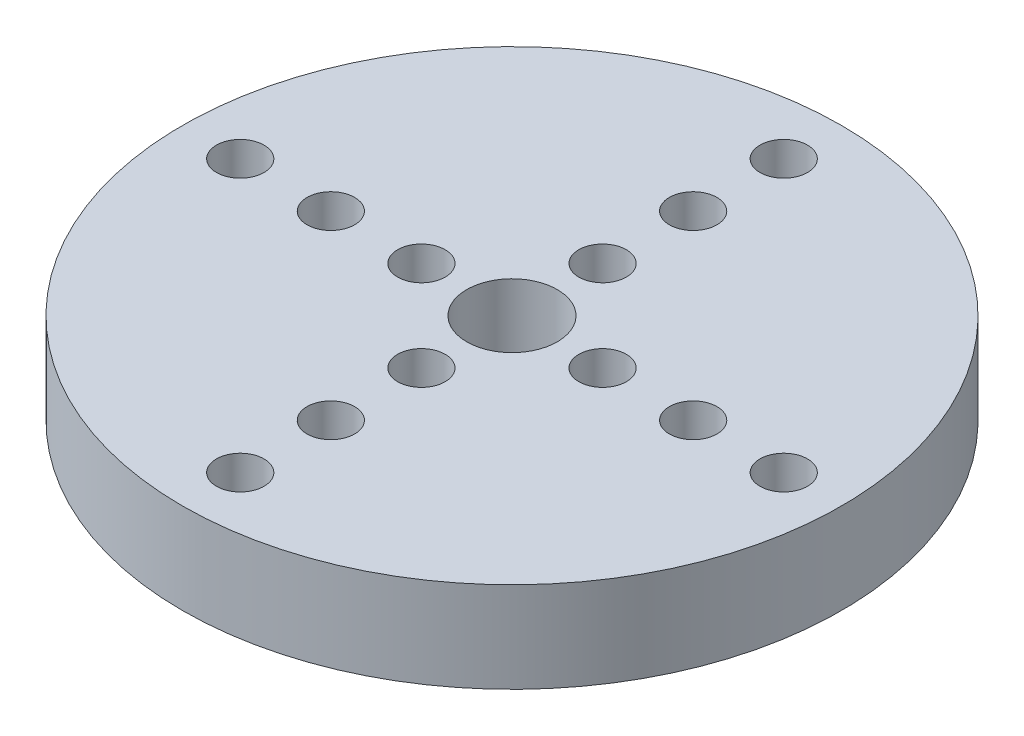
ISO-10303-21;
HEADER;
FILE_DESCRIPTION(('STEP AP214'),'2;1');
FILE_NAME('part.step','',(''),(''),'','','');
FILE_SCHEMA(('AUTOMOTIVE_DESIGN { 1 0 10303 214 1 1 1 1 }'));
ENDSEC;
DATA;
#1=APPLICATION_CONTEXT('core data for automotive mechanical design processes');
#2=APPLICATION_PROTOCOL_DEFINITION('international standard','automotive_design',2000,#1);
#3=PRODUCT_CONTEXT('',#1,'mechanical');
#4=PRODUCT('Part','Part','',(#3));
#5=PRODUCT_RELATED_PRODUCT_CATEGORY('part','',(#4));
#6=PRODUCT_DEFINITION_FORMATION('','',#4);
#7=PRODUCT_DEFINITION_CONTEXT('part definition',#1,'design');
#8=PRODUCT_DEFINITION('design','',#6,#7);
#9=PRODUCT_DEFINITION_SHAPE('','',#8);
#10=(LENGTH_UNIT() NAMED_UNIT(*) SI_UNIT(.MILLI.,.METRE.));
#11=(NAMED_UNIT(*) PLANE_ANGLE_UNIT() SI_UNIT($,.RADIAN.));
#12=(NAMED_UNIT(*) SI_UNIT($,.STERADIAN.) SOLID_ANGLE_UNIT());
#13=UNCERTAINTY_MEASURE_WITH_UNIT(LENGTH_MEASURE(1.E-05),#10,'distance_accuracy_value','');
#14=(GEOMETRIC_REPRESENTATION_CONTEXT(3) GLOBAL_UNCERTAINTY_ASSIGNED_CONTEXT((#13)) GLOBAL_UNIT_ASSIGNED_CONTEXT((#10,
#11,#12)) REPRESENTATION_CONTEXT('',''));
#15=CARTESIAN_POINT('',(0.,0.,0.));
#16=DIRECTION('',(0.,0.,1.));
#17=DIRECTION('',(1.,0.,0.));
#18=AXIS2_PLACEMENT_3D('',#15,#16,#17);
#19=CARTESIAN_POINT('',(0.,8.,0.));
#20=DIRECTION('',(0.,-1.,0.));
#21=DIRECTION('',(0.,0.,-1.));
#22=AXIS2_PLACEMENT_3D('',#19,#20,#21);
#23=CYLINDRICAL_SURFACE('',#22,29.105);
#24=CARTESIAN_POINT('',(0.,8.,0.));
#25=DIRECTION('',(0.,1.,0.));
#26=DIRECTION('',(0.,0.,1.));
#27=AXIS2_PLACEMENT_3D('',#24,#25,#26);
#28=CIRCLE('',#27,29.105);
#29=CARTESIAN_POINT('',(0.,8.,29.105));
#30=VERTEX_POINT('',#29);
#31=EDGE_CURVE('E10',#30,#30,#28,.T.);
#32=ORIENTED_EDGE('',*,*,#31,.F.);
#33=EDGE_LOOP('',(#32));
#34=FACE_BOUND('',#33,.T.);
#35=CARTESIAN_POINT('',(0.,0.,0.));
#36=DIRECTION('',(0.,1.,0.));
#37=DIRECTION('',(0.,0.,1.));
#38=AXIS2_PLACEMENT_3D('',#35,#36,#37);
#39=CIRCLE('',#38,29.105);
#40=CARTESIAN_POINT('',(0.,0.,29.105));
#41=VERTEX_POINT('',#40);
#42=EDGE_CURVE('E34',#41,#41,#39,.T.);
#43=ORIENTED_EDGE('',*,*,#42,.T.);
#44=EDGE_LOOP('',(#43));
#45=FACE_BOUND('',#44,.T.);
#46=ADVANCED_FACE('F31',(#34,#45),#23,.T.);
#47=CARTESIAN_POINT('',(0.,8.,0.));
#48=DIRECTION('',(0.,1.,0.));
#49=DIRECTION('',(0.,0.,1.));
#50=AXIS2_PLACEMENT_3D('',#47,#48,#49);
#51=PLANE('',#50);
#52=CARTESIAN_POINT('',(24.,8.,0.));
#53=DIRECTION('',(0.,1.,0.));
#54=DIRECTION('',(0.,0.,1.));
#55=AXIS2_PLACEMENT_3D('',#52,#53,#54);
#56=CIRCLE('',#55,2.1);
#57=CARTESIAN_POINT('',(24.,8.,2.1));
#58=VERTEX_POINT('',#57);
#59=EDGE_CURVE('E115',#58,#58,#56,.T.);
#60=ORIENTED_EDGE('',*,*,#59,.F.);
#61=EDGE_LOOP('',(#60));
#62=FACE_BOUND('',#61,.T.);
#63=CARTESIAN_POINT('',(16.,8.,0.));
#64=DIRECTION('',(0.,1.,0.));
#65=DIRECTION('',(0.,0.,1.));
#66=AXIS2_PLACEMENT_3D('',#63,#64,#65);
#67=CIRCLE('',#66,2.1);
#68=CARTESIAN_POINT('',(16.,8.,2.1));
#69=VERTEX_POINT('',#68);
#70=EDGE_CURVE('E109',#69,#69,#67,.T.);
#71=ORIENTED_EDGE('',*,*,#70,.F.);
#72=EDGE_LOOP('',(#71));
#73=FACE_BOUND('',#72,.T.);
#74=CARTESIAN_POINT('',(8.,8.,0.));
#75=DIRECTION('',(0.,1.,0.));
#76=DIRECTION('',(0.,0.,1.));
#77=AXIS2_PLACEMENT_3D('',#74,#75,#76);
#78=CIRCLE('',#77,2.1);
#79=CARTESIAN_POINT('',(8.,8.,2.1));
#80=VERTEX_POINT('',#79);
#81=EDGE_CURVE('E103',#80,#80,#78,.T.);
#82=ORIENTED_EDGE('',*,*,#81,.F.);
#83=EDGE_LOOP('',(#82));
#84=FACE_BOUND('',#83,.T.);
#85=CARTESIAN_POINT('',(0.,8.,24.));
#86=DIRECTION('',(0.,1.,0.));
#87=DIRECTION('',(0.,0.,1.));
#88=AXIS2_PLACEMENT_3D('',#85,#86,#87);
#89=CIRCLE('',#88,2.1);
#90=CARTESIAN_POINT('',(0.,8.,26.1));
#91=VERTEX_POINT('',#90);
#92=EDGE_CURVE('E97',#91,#91,#89,.T.);
#93=ORIENTED_EDGE('',*,*,#92,.F.);
#94=EDGE_LOOP('',(#93));
#95=FACE_BOUND('',#94,.T.);
#96=CARTESIAN_POINT('',(0.,8.,16.));
#97=DIRECTION('',(0.,1.,0.));
#98=DIRECTION('',(0.,0.,1.));
#99=AXIS2_PLACEMENT_3D('',#96,#97,#98);
#100=CIRCLE('',#99,2.1);
#101=CARTESIAN_POINT('',(0.,8.,18.1));
#102=VERTEX_POINT('',#101);
#103=EDGE_CURVE('E91',#102,#102,#100,.T.);
#104=ORIENTED_EDGE('',*,*,#103,.F.);
#105=EDGE_LOOP('',(#104));
#106=FACE_BOUND('',#105,.T.);
#107=CARTESIAN_POINT('',(0.,8.,8.));
#108=DIRECTION('',(0.,1.,0.));
#109=DIRECTION('',(0.,0.,1.));
#110=AXIS2_PLACEMENT_3D('',#107,#108,#109);
#111=CIRCLE('',#110,2.1);
#112=CARTESIAN_POINT('',(0.,8.,10.1));
#113=VERTEX_POINT('',#112);
#114=EDGE_CURVE('E85',#113,#113,#111,.T.);
#115=ORIENTED_EDGE('',*,*,#114,.F.);
#116=EDGE_LOOP('',(#115));
#117=FACE_BOUND('',#116,.T.);
#118=CARTESIAN_POINT('',(-24.,8.,0.));
#119=DIRECTION('',(0.,1.,0.));
#120=DIRECTION('',(0.,0.,1.));
#121=AXIS2_PLACEMENT_3D('',#118,#119,#120);
#122=CIRCLE('',#121,2.1);
#123=CARTESIAN_POINT('',(-24.,8.,2.1));
#124=VERTEX_POINT('',#123);
#125=EDGE_CURVE('E79',#124,#124,#122,.T.);
#126=ORIENTED_EDGE('',*,*,#125,.F.);
#127=EDGE_LOOP('',(#126));
#128=FACE_BOUND('',#127,.T.);
#129=CARTESIAN_POINT('',(-16.,8.,0.));
#130=DIRECTION('',(0.,1.,0.));
#131=DIRECTION('',(0.,0.,1.));
#132=AXIS2_PLACEMENT_3D('',#129,#130,#131);
#133=CIRCLE('',#132,2.1);
#134=CARTESIAN_POINT('',(-16.,8.,2.1));
#135=VERTEX_POINT('',#134);
#136=EDGE_CURVE('E73',#135,#135,#133,.T.);
#137=ORIENTED_EDGE('',*,*,#136,.F.);
#138=EDGE_LOOP('',(#137));
#139=FACE_BOUND('',#138,.T.);
#140=CARTESIAN_POINT('',(-8.,8.,0.));
#141=DIRECTION('',(0.,1.,0.));
#142=DIRECTION('',(0.,0.,1.));
#143=AXIS2_PLACEMENT_3D('',#140,#141,#142);
#144=CIRCLE('',#143,2.1);
#145=CARTESIAN_POINT('',(-8.,8.,2.1));
#146=VERTEX_POINT('',#145);
#147=EDGE_CURVE('E67',#146,#146,#144,.T.);
#148=ORIENTED_EDGE('',*,*,#147,.F.);
#149=EDGE_LOOP('',(#148));
#150=FACE_BOUND('',#149,.T.);
#151=CARTESIAN_POINT('',(0.,8.,-24.));
#152=DIRECTION('',(0.,1.,0.));
#153=DIRECTION('',(0.,0.,1.));
#154=AXIS2_PLACEMENT_3D('',#151,#152,#153);
#155=CIRCLE('',#154,2.1);
#156=CARTESIAN_POINT('',(0.,8.,-21.9));
#157=VERTEX_POINT('',#156);
#158=EDGE_CURVE('E61',#157,#157,#155,.T.);
#159=ORIENTED_EDGE('',*,*,#158,.F.);
#160=EDGE_LOOP('',(#159));
#161=FACE_BOUND('',#160,.T.);
#162=CARTESIAN_POINT('',(0.,8.,-16.));
#163=DIRECTION('',(0.,1.,0.));
#164=DIRECTION('',(0.,0.,1.));
#165=AXIS2_PLACEMENT_3D('',#162,#163,#164);
#166=CIRCLE('',#165,2.1);
#167=CARTESIAN_POINT('',(0.,8.,-13.9));
#168=VERTEX_POINT('',#167);
#169=EDGE_CURVE('E55',#168,#168,#166,.T.);
#170=ORIENTED_EDGE('',*,*,#169,.F.);
#171=EDGE_LOOP('',(#170));
#172=FACE_BOUND('',#171,.T.);
#173=CARTESIAN_POINT('',(0.,8.,-8.));
#174=DIRECTION('',(0.,1.,0.));
#175=DIRECTION('',(0.,0.,1.));
#176=AXIS2_PLACEMENT_3D('',#173,#174,#175);
#177=CIRCLE('',#176,2.1);
#178=CARTESIAN_POINT('',(0.,8.,-5.9));
#179=VERTEX_POINT('',#178);
#180=EDGE_CURVE('E49',#179,#179,#177,.T.);
#181=ORIENTED_EDGE('',*,*,#180,.F.);
#182=EDGE_LOOP('',(#181));
#183=FACE_BOUND('',#182,.T.);
#184=CARTESIAN_POINT('',(0.,8.,0.));
#185=DIRECTION('',(0.,1.,0.));
#186=DIRECTION('',(0.,0.,1.));
#187=AXIS2_PLACEMENT_3D('',#184,#185,#186);
#188=CIRCLE('',#187,4.);
#189=CARTESIAN_POINT('',(0.,8.,4.));
#190=VERTEX_POINT('',#189);
#191=EDGE_CURVE('E43',#190,#190,#188,.T.);
#192=ORIENTED_EDGE('',*,*,#191,.F.);
#193=EDGE_LOOP('',(#192));
#194=FACE_BOUND('',#193,.T.);
#195=ORIENTED_EDGE('',*,*,#31,.T.);
#196=EDGE_LOOP('',(#195));
#197=FACE_BOUND('',#196,.T.);
#198=ADVANCED_FACE('F131',(#62,#73,#84,#95,#106,#117,#128,#139,#150,#161,#172,#183,#194,#197),
#51,.T.);
#199=CARTESIAN_POINT('',(0.,0.,0.));
#200=DIRECTION('',(0.,1.,0.));
#201=DIRECTION('',(0.,0.,1.));
#202=AXIS2_PLACEMENT_3D('',#199,#200,#201);
#203=PLANE('',#202);
#204=CARTESIAN_POINT('',(24.,0.,0.));
#205=DIRECTION('',(0.,1.,0.));
#206=DIRECTION('',(0.,0.,1.));
#207=AXIS2_PLACEMENT_3D('',#204,#205,#206);
#208=CIRCLE('',#207,2.1);
#209=CARTESIAN_POINT('',(24.,0.,2.1));
#210=VERTEX_POINT('',#209);
#211=EDGE_CURVE('E112',#210,#210,#208,.T.);
#212=ORIENTED_EDGE('',*,*,#211,.T.);
#213=EDGE_LOOP('',(#212));
#214=FACE_BOUND('',#213,.T.);
#215=CARTESIAN_POINT('',(16.,0.,0.));
#216=DIRECTION('',(0.,1.,0.));
#217=DIRECTION('',(0.,0.,1.));
#218=AXIS2_PLACEMENT_3D('',#215,#216,#217);
#219=CIRCLE('',#218,2.1);
#220=CARTESIAN_POINT('',(16.,0.,2.1));
#221=VERTEX_POINT('',#220);
#222=EDGE_CURVE('E106',#221,#221,#219,.T.);
#223=ORIENTED_EDGE('',*,*,#222,.T.);
#224=EDGE_LOOP('',(#223));
#225=FACE_BOUND('',#224,.T.);
#226=CARTESIAN_POINT('',(8.,0.,0.));
#227=DIRECTION('',(0.,1.,0.));
#228=DIRECTION('',(0.,0.,1.));
#229=AXIS2_PLACEMENT_3D('',#226,#227,#228);
#230=CIRCLE('',#229,2.1);
#231=CARTESIAN_POINT('',(8.,0.,2.1));
#232=VERTEX_POINT('',#231);
#233=EDGE_CURVE('E100',#232,#232,#230,.T.);
#234=ORIENTED_EDGE('',*,*,#233,.T.);
#235=EDGE_LOOP('',(#234));
#236=FACE_BOUND('',#235,.T.);
#237=CARTESIAN_POINT('',(0.,0.,24.));
#238=DIRECTION('',(0.,1.,0.));
#239=DIRECTION('',(0.,0.,1.));
#240=AXIS2_PLACEMENT_3D('',#237,#238,#239);
#241=CIRCLE('',#240,2.1);
#242=CARTESIAN_POINT('',(0.,0.,26.1));
#243=VERTEX_POINT('',#242);
#244=EDGE_CURVE('E94',#243,#243,#241,.T.);
#245=ORIENTED_EDGE('',*,*,#244,.T.);
#246=EDGE_LOOP('',(#245));
#247=FACE_BOUND('',#246,.T.);
#248=CARTESIAN_POINT('',(0.,0.,16.));
#249=DIRECTION('',(0.,1.,0.));
#250=DIRECTION('',(0.,0.,1.));
#251=AXIS2_PLACEMENT_3D('',#248,#249,#250);
#252=CIRCLE('',#251,2.1);
#253=CARTESIAN_POINT('',(0.,0.,18.1));
#254=VERTEX_POINT('',#253);
#255=EDGE_CURVE('E88',#254,#254,#252,.T.);
#256=ORIENTED_EDGE('',*,*,#255,.T.);
#257=EDGE_LOOP('',(#256));
#258=FACE_BOUND('',#257,.T.);
#259=CARTESIAN_POINT('',(0.,0.,8.));
#260=DIRECTION('',(0.,1.,0.));
#261=DIRECTION('',(0.,0.,1.));
#262=AXIS2_PLACEMENT_3D('',#259,#260,#261);
#263=CIRCLE('',#262,2.1);
#264=CARTESIAN_POINT('',(0.,0.,10.1));
#265=VERTEX_POINT('',#264);
#266=EDGE_CURVE('E82',#265,#265,#263,.T.);
#267=ORIENTED_EDGE('',*,*,#266,.T.);
#268=EDGE_LOOP('',(#267));
#269=FACE_BOUND('',#268,.T.);
#270=CARTESIAN_POINT('',(-24.,0.,0.));
#271=DIRECTION('',(0.,1.,0.));
#272=DIRECTION('',(0.,0.,1.));
#273=AXIS2_PLACEMENT_3D('',#270,#271,#272);
#274=CIRCLE('',#273,2.1);
#275=CARTESIAN_POINT('',(-24.,0.,2.1));
#276=VERTEX_POINT('',#275);
#277=EDGE_CURVE('E76',#276,#276,#274,.T.);
#278=ORIENTED_EDGE('',*,*,#277,.T.);
#279=EDGE_LOOP('',(#278));
#280=FACE_BOUND('',#279,.T.);
#281=CARTESIAN_POINT('',(-16.,0.,0.));
#282=DIRECTION('',(0.,1.,0.));
#283=DIRECTION('',(0.,0.,1.));
#284=AXIS2_PLACEMENT_3D('',#281,#282,#283);
#285=CIRCLE('',#284,2.1);
#286=CARTESIAN_POINT('',(-16.,0.,2.1));
#287=VERTEX_POINT('',#286);
#288=EDGE_CURVE('E70',#287,#287,#285,.T.);
#289=ORIENTED_EDGE('',*,*,#288,.T.);
#290=EDGE_LOOP('',(#289));
#291=FACE_BOUND('',#290,.T.);
#292=CARTESIAN_POINT('',(-8.,0.,0.));
#293=DIRECTION('',(0.,1.,0.));
#294=DIRECTION('',(0.,0.,1.));
#295=AXIS2_PLACEMENT_3D('',#292,#293,#294);
#296=CIRCLE('',#295,2.1);
#297=CARTESIAN_POINT('',(-8.,0.,2.1));
#298=VERTEX_POINT('',#297);
#299=EDGE_CURVE('E64',#298,#298,#296,.T.);
#300=ORIENTED_EDGE('',*,*,#299,.T.);
#301=EDGE_LOOP('',(#300));
#302=FACE_BOUND('',#301,.T.);
#303=CARTESIAN_POINT('',(0.,0.,-24.));
#304=DIRECTION('',(0.,1.,0.));
#305=DIRECTION('',(0.,0.,1.));
#306=AXIS2_PLACEMENT_3D('',#303,#304,#305);
#307=CIRCLE('',#306,2.1);
#308=CARTESIAN_POINT('',(0.,0.,-21.9));
#309=VERTEX_POINT('',#308);
#310=EDGE_CURVE('E58',#309,#309,#307,.T.);
#311=ORIENTED_EDGE('',*,*,#310,.T.);
#312=EDGE_LOOP('',(#311));
#313=FACE_BOUND('',#312,.T.);
#314=CARTESIAN_POINT('',(0.,0.,-16.));
#315=DIRECTION('',(0.,1.,0.));
#316=DIRECTION('',(0.,0.,1.));
#317=AXIS2_PLACEMENT_3D('',#314,#315,#316);
#318=CIRCLE('',#317,2.1);
#319=CARTESIAN_POINT('',(0.,0.,-13.9));
#320=VERTEX_POINT('',#319);
#321=EDGE_CURVE('E52',#320,#320,#318,.T.);
#322=ORIENTED_EDGE('',*,*,#321,.T.);
#323=EDGE_LOOP('',(#322));
#324=FACE_BOUND('',#323,.T.);
#325=CARTESIAN_POINT('',(0.,0.,-8.));
#326=DIRECTION('',(0.,1.,0.));
#327=DIRECTION('',(0.,0.,1.));
#328=AXIS2_PLACEMENT_3D('',#325,#326,#327);
#329=CIRCLE('',#328,2.1);
#330=CARTESIAN_POINT('',(0.,0.,-5.9));
#331=VERTEX_POINT('',#330);
#332=EDGE_CURVE('E46',#331,#331,#329,.T.);
#333=ORIENTED_EDGE('',*,*,#332,.T.);
#334=EDGE_LOOP('',(#333));
#335=FACE_BOUND('',#334,.T.);
#336=CARTESIAN_POINT('',(0.,0.,0.));
#337=DIRECTION('',(0.,1.,0.));
#338=DIRECTION('',(0.,0.,1.));
#339=AXIS2_PLACEMENT_3D('',#336,#337,#338);
#340=CIRCLE('',#339,4.);
#341=CARTESIAN_POINT('',(0.,0.,4.));
#342=VERTEX_POINT('',#341);
#343=EDGE_CURVE('E41',#342,#342,#340,.T.);
#344=ORIENTED_EDGE('',*,*,#343,.T.);
#345=EDGE_LOOP('',(#344));
#346=FACE_BOUND('',#345,.T.);
#347=ORIENTED_EDGE('',*,*,#42,.F.);
#348=EDGE_LOOP('',(#347));
#349=FACE_BOUND('',#348,.T.);
#350=ADVANCED_FACE('F121',(#214,#225,#236,#247,#258,#269,#280,#291,#302,#313,#324,#335,#346,
#349),#203,.F.);
#351=CARTESIAN_POINT('',(0.,0.,0.));
#352=DIRECTION('',(0.,1.,0.));
#353=DIRECTION('',(0.,0.,1.));
#354=AXIS2_PLACEMENT_3D('',#351,#352,#353);
#355=CYLINDRICAL_SURFACE('',#354,4.);
#356=ORIENTED_EDGE('',*,*,#343,.F.);
#357=EDGE_LOOP('',(#356));
#358=FACE_BOUND('',#357,.T.);
#359=ORIENTED_EDGE('',*,*,#191,.T.);
#360=EDGE_LOOP('',(#359));
#361=FACE_BOUND('',#360,.T.);
#362=ADVANCED_FACE('F159',(#358,#361),#355,.F.);
#363=CARTESIAN_POINT('',(0.,0.,-8.));
#364=DIRECTION('',(0.,1.,0.));
#365=DIRECTION('',(0.,0.,1.));
#366=AXIS2_PLACEMENT_3D('',#363,#364,#365);
#367=CYLINDRICAL_SURFACE('',#366,2.1);
#368=ORIENTED_EDGE('',*,*,#332,.F.);
#369=EDGE_LOOP('',(#368));
#370=FACE_BOUND('',#369,.T.);
#371=ORIENTED_EDGE('',*,*,#180,.T.);
#372=EDGE_LOOP('',(#371));
#373=FACE_BOUND('',#372,.T.);
#374=ADVANCED_FACE('F161',(#370,#373),#367,.F.);
#375=CARTESIAN_POINT('',(0.,0.,-16.));
#376=DIRECTION('',(0.,1.,0.));
#377=DIRECTION('',(0.,0.,1.));
#378=AXIS2_PLACEMENT_3D('',#375,#376,#377);
#379=CYLINDRICAL_SURFACE('',#378,2.1);
#380=ORIENTED_EDGE('',*,*,#321,.F.);
#381=EDGE_LOOP('',(#380));
#382=FACE_BOUND('',#381,.T.);
#383=ORIENTED_EDGE('',*,*,#169,.T.);
#384=EDGE_LOOP('',(#383));
#385=FACE_BOUND('',#384,.T.);
#386=ADVANCED_FACE('F168',(#382,#385),#379,.F.);
#387=CARTESIAN_POINT('',(0.,0.,-24.));
#388=DIRECTION('',(0.,1.,0.));
#389=DIRECTION('',(0.,0.,1.));
#390=AXIS2_PLACEMENT_3D('',#387,#388,#389);
#391=CYLINDRICAL_SURFACE('',#390,2.1);
#392=ORIENTED_EDGE('',*,*,#310,.F.);
#393=EDGE_LOOP('',(#392));
#394=FACE_BOUND('',#393,.T.);
#395=ORIENTED_EDGE('',*,*,#158,.T.);
#396=EDGE_LOOP('',(#395));
#397=FACE_BOUND('',#396,.T.);
#398=ADVANCED_FACE('F203',(#394,#397),#391,.F.);
#399=CARTESIAN_POINT('',(-8.,0.,0.));
#400=DIRECTION('',(0.,1.,0.));
#401=DIRECTION('',(0.,0.,1.));
#402=AXIS2_PLACEMENT_3D('',#399,#400,#401);
#403=CYLINDRICAL_SURFACE('',#402,2.1);
#404=ORIENTED_EDGE('',*,*,#299,.F.);
#405=EDGE_LOOP('',(#404));
#406=FACE_BOUND('',#405,.T.);
#407=ORIENTED_EDGE('',*,*,#147,.T.);
#408=EDGE_LOOP('',(#407));
#409=FACE_BOUND('',#408,.T.);
#410=ADVANCED_FACE('F213',(#406,#409),#403,.F.);
#411=CARTESIAN_POINT('',(-16.,0.,0.));
#412=DIRECTION('',(0.,1.,0.));
#413=DIRECTION('',(0.,0.,1.));
#414=AXIS2_PLACEMENT_3D('',#411,#412,#413);
#415=CYLINDRICAL_SURFACE('',#414,2.1);
#416=ORIENTED_EDGE('',*,*,#288,.F.);
#417=EDGE_LOOP('',(#416));
#418=FACE_BOUND('',#417,.T.);
#419=ORIENTED_EDGE('',*,*,#136,.T.);
#420=EDGE_LOOP('',(#419));
#421=FACE_BOUND('',#420,.T.);
#422=ADVANCED_FACE('F223',(#418,#421),#415,.F.);
#423=CARTESIAN_POINT('',(-24.,0.,0.));
#424=DIRECTION('',(0.,1.,0.));
#425=DIRECTION('',(0.,0.,1.));
#426=AXIS2_PLACEMENT_3D('',#423,#424,#425);
#427=CYLINDRICAL_SURFACE('',#426,2.1);
#428=ORIENTED_EDGE('',*,*,#277,.F.);
#429=EDGE_LOOP('',(#428));
#430=FACE_BOUND('',#429,.T.);
#431=ORIENTED_EDGE('',*,*,#125,.T.);
#432=EDGE_LOOP('',(#431));
#433=FACE_BOUND('',#432,.T.);
#434=ADVANCED_FACE('F233',(#430,#433),#427,.F.);
#435=CARTESIAN_POINT('',(0.,0.,8.));
#436=DIRECTION('',(0.,1.,0.));
#437=DIRECTION('',(0.,0.,1.));
#438=AXIS2_PLACEMENT_3D('',#435,#436,#437);
#439=CYLINDRICAL_SURFACE('',#438,2.1);
#440=ORIENTED_EDGE('',*,*,#266,.F.);
#441=EDGE_LOOP('',(#440));
#442=FACE_BOUND('',#441,.T.);
#443=ORIENTED_EDGE('',*,*,#114,.T.);
#444=EDGE_LOOP('',(#443));
#445=FACE_BOUND('',#444,.T.);
#446=ADVANCED_FACE('F243',(#442,#445),#439,.F.);
#447=CARTESIAN_POINT('',(0.,0.,16.));
#448=DIRECTION('',(0.,1.,0.));
#449=DIRECTION('',(0.,0.,1.));
#450=AXIS2_PLACEMENT_3D('',#447,#448,#449);
#451=CYLINDRICAL_SURFACE('',#450,2.1);
#452=ORIENTED_EDGE('',*,*,#255,.F.);
#453=EDGE_LOOP('',(#452));
#454=FACE_BOUND('',#453,.T.);
#455=ORIENTED_EDGE('',*,*,#103,.T.);
#456=EDGE_LOOP('',(#455));
#457=FACE_BOUND('',#456,.T.);
#458=ADVANCED_FACE('F253',(#454,#457),#451,.F.);
#459=CARTESIAN_POINT('',(0.,0.,24.));
#460=DIRECTION('',(0.,1.,0.));
#461=DIRECTION('',(0.,0.,1.));
#462=AXIS2_PLACEMENT_3D('',#459,#460,#461);
#463=CYLINDRICAL_SURFACE('',#462,2.1);
#464=ORIENTED_EDGE('',*,*,#244,.F.);
#465=EDGE_LOOP('',(#464));
#466=FACE_BOUND('',#465,.T.);
#467=ORIENTED_EDGE('',*,*,#92,.T.);
#468=EDGE_LOOP('',(#467));
#469=FACE_BOUND('',#468,.T.);
#470=ADVANCED_FACE('F263',(#466,#469),#463,.F.);
#471=CARTESIAN_POINT('',(8.,0.,0.));
#472=DIRECTION('',(0.,1.,0.));
#473=DIRECTION('',(0.,0.,1.));
#474=AXIS2_PLACEMENT_3D('',#471,#472,#473);
#475=CYLINDRICAL_SURFACE('',#474,2.1);
#476=ORIENTED_EDGE('',*,*,#233,.F.);
#477=EDGE_LOOP('',(#476));
#478=FACE_BOUND('',#477,.T.);
#479=ORIENTED_EDGE('',*,*,#81,.T.);
#480=EDGE_LOOP('',(#479));
#481=FACE_BOUND('',#480,.T.);
#482=ADVANCED_FACE('F273',(#478,#481),#475,.F.);
#483=CARTESIAN_POINT('',(16.,0.,0.));
#484=DIRECTION('',(0.,1.,0.));
#485=DIRECTION('',(0.,0.,1.));
#486=AXIS2_PLACEMENT_3D('',#483,#484,#485);
#487=CYLINDRICAL_SURFACE('',#486,2.1);
#488=ORIENTED_EDGE('',*,*,#222,.F.);
#489=EDGE_LOOP('',(#488));
#490=FACE_BOUND('',#489,.T.);
#491=ORIENTED_EDGE('',*,*,#70,.T.);
#492=EDGE_LOOP('',(#491));
#493=FACE_BOUND('',#492,.T.);
#494=ADVANCED_FACE('F127',(#490,#493),#487,.F.);
#495=CARTESIAN_POINT('',(24.,0.,0.));
#496=DIRECTION('',(0.,1.,0.));
#497=DIRECTION('',(0.,0.,1.));
#498=AXIS2_PLACEMENT_3D('',#495,#496,#497);
#499=CYLINDRICAL_SURFACE('',#498,2.1);
#500=ORIENTED_EDGE('',*,*,#211,.F.);
#501=EDGE_LOOP('',(#500));
#502=FACE_BOUND('',#501,.T.);
#503=ORIENTED_EDGE('',*,*,#59,.T.);
#504=EDGE_LOOP('',(#503));
#505=FACE_BOUND('',#504,.T.);
#506=ADVANCED_FACE('F124',(#502,#505),#499,.F.);
#507=CLOSED_SHELL('',(#46,#198,#350,#362,#374,#386,#398,#410,#422,#434,#446,#458,#470,#482,#494,#506));
#508=MANIFOLD_SOLID_BREP('B2',#507);
#509=ADVANCED_BREP_SHAPE_REPRESENTATION('',(#18,#508),#14);
#510=SHAPE_DEFINITION_REPRESENTATION(#9,#509);
ENDSEC;
END-ISO-10303-21;
